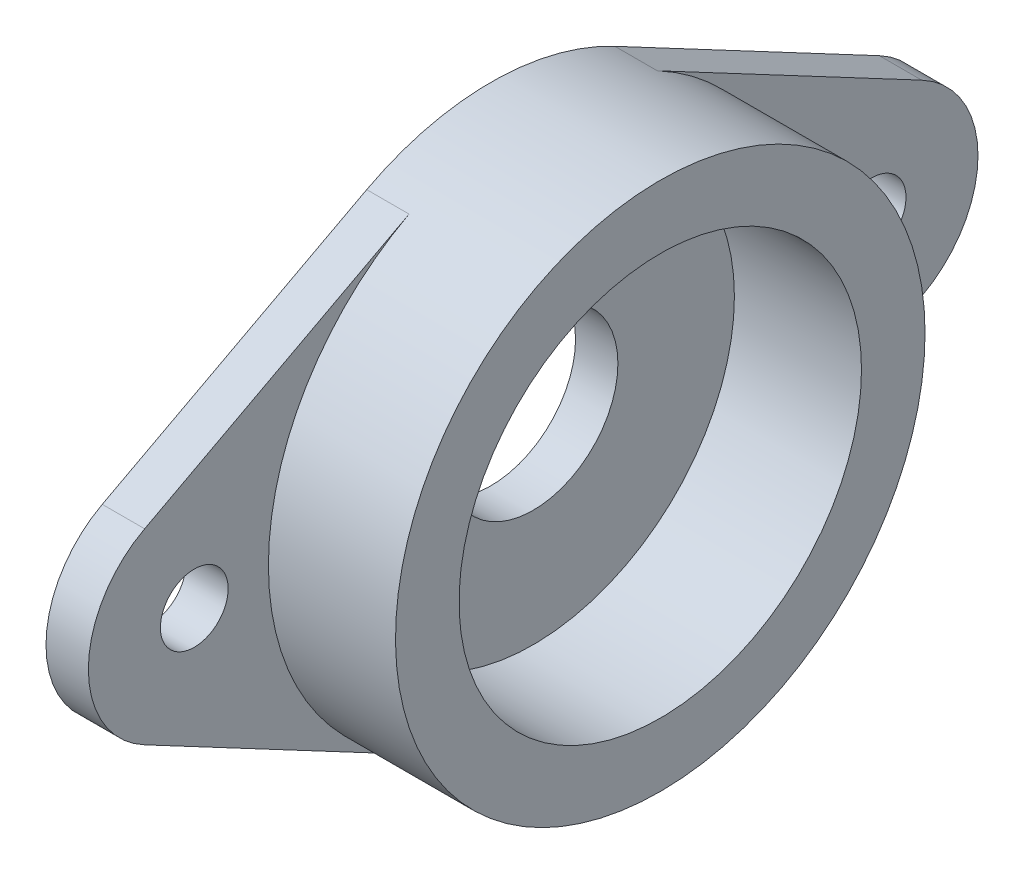
ISO-10303-21;
HEADER;
FILE_DESCRIPTION(('STEP AP214'),'2;1');
FILE_NAME('part.step','',(''),(''),'','','');
FILE_SCHEMA(('AUTOMOTIVE_DESIGN { 1 0 10303 214 1 1 1 1 }'));
ENDSEC;
DATA;
#1=APPLICATION_CONTEXT('core data for automotive mechanical design processes');
#2=APPLICATION_PROTOCOL_DEFINITION('international standard','automotive_design',2000,#1);
#3=PRODUCT_CONTEXT('',#1,'mechanical');
#4=PRODUCT('Part','Part','',(#3));
#5=PRODUCT_RELATED_PRODUCT_CATEGORY('part','',(#4));
#6=PRODUCT_DEFINITION_FORMATION('','',#4);
#7=PRODUCT_DEFINITION_CONTEXT('part definition',#1,'design');
#8=PRODUCT_DEFINITION('design','',#6,#7);
#9=PRODUCT_DEFINITION_SHAPE('','',#8);
#10=(LENGTH_UNIT() NAMED_UNIT(*) SI_UNIT(.MILLI.,.METRE.));
#11=(NAMED_UNIT(*) PLANE_ANGLE_UNIT() SI_UNIT($,.RADIAN.));
#12=(NAMED_UNIT(*) SI_UNIT($,.STERADIAN.) SOLID_ANGLE_UNIT());
#13=UNCERTAINTY_MEASURE_WITH_UNIT(LENGTH_MEASURE(1.E-05),#10,'distance_accuracy_value','');
#14=(GEOMETRIC_REPRESENTATION_CONTEXT(3) GLOBAL_UNCERTAINTY_ASSIGNED_CONTEXT((#13)) GLOBAL_UNIT_ASSIGNED_CONTEXT((#10,
#11,#12)) REPRESENTATION_CONTEXT('',''));
#15=CARTESIAN_POINT('',(0.,0.,0.));
#16=DIRECTION('',(0.,0.,1.));
#17=DIRECTION('',(1.,0.,0.));
#18=AXIS2_PLACEMENT_3D('',#15,#16,#17);
#19=CARTESIAN_POINT('',(49.3553390593274,0.,0.));
#20=DIRECTION('',(-1.,0.,0.));
#21=DIRECTION('',(0.,0.,1.));
#22=AXIS2_PLACEMENT_3D('',#19,#20,#21);
#23=CYLINDRICAL_SURFACE('',#22,12.5);
#24=CARTESIAN_POINT('',(8.,0.,0.));
#25=DIRECTION('',(1.,0.,0.));
#26=DIRECTION('',(0.,0.,-1.));
#27=AXIS2_PLACEMENT_3D('',#24,#25,#26);
#28=CIRCLE('',#27,12.5);
#29=CARTESIAN_POINT('',(8.,0.,-12.5));
#30=VERTEX_POINT('',#29);
#31=EDGE_CURVE('E128',#30,#30,#28,.F.);
#32=ORIENTED_EDGE('',*,*,#31,.T.);
#33=EDGE_LOOP('',(#32));
#34=FACE_BOUND('',#33,.T.);
#35=CARTESIAN_POINT('',(0.,0.,0.));
#36=DIRECTION('',(1.,0.,0.));
#37=DIRECTION('',(0.,0.,-1.));
#38=AXIS2_PLACEMENT_3D('',#35,#36,#37);
#39=CIRCLE('',#38,12.5);
#40=CARTESIAN_POINT('',(0.,-11.0416359571114,-5.859375));
#41=VERTEX_POINT('',#40);
#42=CARTESIAN_POINT('',(0.,-11.0416359571114,5.859375));
#43=VERTEX_POINT('',#42);
#44=EDGE_CURVE('E186',#41,#43,#39,.F.);
#45=ORIENTED_EDGE('',*,*,#44,.F.);
#46=DIRECTION('',(-1.,0.,0.));
#47=VECTOR('',#46,1.);
#48=CARTESIAN_POINT('',(2.,-11.0416359571114,-5.859375));
#49=LINE('',#48,#47);
#50=CARTESIAN_POINT('',(2.,-11.0416359571114,-5.859375));
#51=VERTEX_POINT('',#50);
#52=EDGE_CURVE('E156',#51,#41,#49,.T.);
#53=ORIENTED_EDGE('',*,*,#52,.F.);
#54=CARTESIAN_POINT('',(2.,0.,0.));
#55=DIRECTION('',(1.,0.,0.));
#56=DIRECTION('',(0.,0.,-1.));
#57=AXIS2_PLACEMENT_3D('',#54,#55,#56);
#58=CIRCLE('',#57,12.5);
#59=CARTESIAN_POINT('',(2.,11.0416359571114,-5.859375));
#60=VERTEX_POINT('',#59);
#61=EDGE_CURVE('E142',#60,#51,#58,.F.);
#62=ORIENTED_EDGE('',*,*,#61,.F.);
#63=DIRECTION('',(-1.,0.,0.));
#64=VECTOR('',#63,1.);
#65=CARTESIAN_POINT('',(2.,11.0416359571114,-5.859375));
#66=LINE('',#65,#64);
#67=CARTESIAN_POINT('',(0.,11.0416359571114,-5.859375));
#68=VERTEX_POINT('',#67);
#69=EDGE_CURVE('E171',#60,#68,#66,.T.);
#70=ORIENTED_EDGE('',*,*,#69,.T.);
#71=CARTESIAN_POINT('',(0.,11.0416359571114,5.859375));
#72=VERTEX_POINT('',#71);
#73=EDGE_CURVE('E182',#72,#68,#39,.F.);
#74=ORIENTED_EDGE('',*,*,#73,.F.);
#75=DIRECTION('',(-1.,0.,0.));
#76=VECTOR('',#75,1.);
#77=CARTESIAN_POINT('',(2.,11.0416359571114,5.859375));
#78=LINE('',#77,#76);
#79=CARTESIAN_POINT('',(2.,11.0416359571114,5.859375));
#80=VERTEX_POINT('',#79);
#81=EDGE_CURVE('E221',#80,#72,#78,.T.);
#82=ORIENTED_EDGE('',*,*,#81,.F.);
#83=CARTESIAN_POINT('',(2.,0.,0.));
#84=DIRECTION('',(1.,0.,0.));
#85=DIRECTION('',(0.,0.,-1.));
#86=AXIS2_PLACEMENT_3D('',#83,#84,#85);
#87=CIRCLE('',#86,12.5);
#88=CARTESIAN_POINT('',(2.,-11.0416359571114,5.859375));
#89=VERTEX_POINT('',#88);
#90=EDGE_CURVE('E201',#89,#80,#87,.F.);
#91=ORIENTED_EDGE('',*,*,#90,.F.);
#92=DIRECTION('',(-1.,0.,0.));
#93=VECTOR('',#92,1.);
#94=CARTESIAN_POINT('',(2.,-11.0416359571114,5.859375));
#95=LINE('',#94,#93);
#96=EDGE_CURVE('E58',#89,#43,#95,.T.);
#97=ORIENTED_EDGE('',*,*,#96,.T.);
#98=EDGE_LOOP('',(#45,#53,#62,#70,#74,#82,#91,#97));
#99=FACE_BOUND('',#98,.T.);
#100=ADVANCED_FACE('F49',(#34,#99),#23,.T.);
#101=CARTESIAN_POINT('',(2.,0.,16.));
#102=DIRECTION('',(-1.,0.,0.));
#103=DIRECTION('',(0.,0.,1.));
#104=AXIS2_PLACEMENT_3D('',#101,#102,#103);
#105=CYLINDRICAL_SURFACE('',#104,5.);
#106=CARTESIAN_POINT('',(0.,0.,16.));
#107=DIRECTION('',(1.,0.,0.));
#108=DIRECTION('',(0.,0.,-1.));
#109=AXIS2_PLACEMENT_3D('',#106,#107,#108);
#110=CIRCLE('',#109,5.);
#111=CARTESIAN_POINT('',(0.,-4.41665438284456,18.34375));
#112=VERTEX_POINT('',#111);
#113=CARTESIAN_POINT('',(0.,4.41665438284455,18.34375));
#114=VERTEX_POINT('',#113);
#115=EDGE_CURVE('E210',#112,#114,#110,.F.);
#116=ORIENTED_EDGE('',*,*,#115,.F.);
#117=DIRECTION('',(-1.,0.,0.));
#118=VECTOR('',#117,1.);
#119=CARTESIAN_POINT('',(2.,-4.41665438284456,18.34375));
#120=LINE('',#119,#118);
#121=CARTESIAN_POINT('',(2.,-4.41665438284456,18.34375));
#122=VERTEX_POINT('',#121);
#123=EDGE_CURVE('E12',#122,#112,#120,.T.);
#124=ORIENTED_EDGE('',*,*,#123,.F.);
#125=CARTESIAN_POINT('',(2.,0.,16.));
#126=DIRECTION('',(1.,0.,0.));
#127=DIRECTION('',(0.,0.,-1.));
#128=AXIS2_PLACEMENT_3D('',#125,#126,#127);
#129=CIRCLE('',#128,5.);
#130=CARTESIAN_POINT('',(2.,4.41665438284455,18.34375));
#131=VERTEX_POINT('',#130);
#132=EDGE_CURVE('E194',#122,#131,#129,.F.);
#133=ORIENTED_EDGE('',*,*,#132,.T.);
#134=DIRECTION('',(-1.,0.,0.));
#135=VECTOR('',#134,1.);
#136=CARTESIAN_POINT('',(2.,4.41665438284455,18.34375));
#137=LINE('',#136,#135);
#138=EDGE_CURVE('E74',#131,#114,#137,.T.);
#139=ORIENTED_EDGE('',*,*,#138,.T.);
#140=EDGE_LOOP('',(#116,#124,#133,#139));
#141=FACE_BOUND('',#140,.T.);
#142=ADVANCED_FACE('F237',(#141),#105,.T.);
#143=CARTESIAN_POINT('',(2.,-11.0416359571114,5.859375));
#144=DIRECTION('',(0.,0.883330876568911,-0.46875));
#145=DIRECTION('',(0.,0.46875,0.883330876568911));
#146=AXIS2_PLACEMENT_3D('',#143,#144,#145);
#147=PLANE('',#146);
#148=DIRECTION('',(0.,-0.46875,-0.883330876568911));
#149=VECTOR('',#148,1.);
#150=CARTESIAN_POINT('',(0.,-11.0416359571114,5.859375));
#151=LINE('',#150,#149);
#152=EDGE_CURVE('E213',#112,#43,#151,.T.);
#153=ORIENTED_EDGE('',*,*,#152,.T.);
#154=ORIENTED_EDGE('',*,*,#96,.F.);
#155=DIRECTION('',(0.,-0.46875,-0.883330876568911));
#156=VECTOR('',#155,1.);
#157=CARTESIAN_POINT('',(2.,-11.0416359571114,5.859375));
#158=LINE('',#157,#156);
#159=EDGE_CURVE('E198',#122,#89,#158,.T.);
#160=ORIENTED_EDGE('',*,*,#159,.F.);
#161=ORIENTED_EDGE('',*,*,#123,.T.);
#162=EDGE_LOOP('',(#153,#154,#160,#161));
#163=FACE_BOUND('',#162,.T.);
#164=ADVANCED_FACE('F232',(#163),#147,.F.);
#165=CARTESIAN_POINT('',(2.,0.,16.));
#166=DIRECTION('',(-1.,0.,0.));
#167=DIRECTION('',(0.,0.,1.));
#168=AXIS2_PLACEMENT_3D('',#165,#166,#167);
#169=CYLINDRICAL_SURFACE('',#168,1.6);
#170=CARTESIAN_POINT('',(2.,0.,16.));
#171=DIRECTION('',(1.,0.,0.));
#172=DIRECTION('',(0.,0.,-1.));
#173=AXIS2_PLACEMENT_3D('',#170,#171,#172);
#174=CIRCLE('',#173,1.6);
#175=CARTESIAN_POINT('',(2.,0.,14.4));
#176=VERTEX_POINT('',#175);
#177=EDGE_CURVE('E190',#176,#176,#174,.T.);
#178=ORIENTED_EDGE('',*,*,#177,.T.);
#179=EDGE_LOOP('',(#178));
#180=FACE_BOUND('',#179,.T.);
#181=CARTESIAN_POINT('',(0.,0.,16.));
#182=DIRECTION('',(1.,0.,0.));
#183=DIRECTION('',(0.,0.,-1.));
#184=AXIS2_PLACEMENT_3D('',#181,#182,#183);
#185=CIRCLE('',#184,1.6);
#186=CARTESIAN_POINT('',(0.,0.,14.4));
#187=VERTEX_POINT('',#186);
#188=EDGE_CURVE('E181',#187,#187,#185,.T.);
#189=ORIENTED_EDGE('',*,*,#188,.F.);
#190=EDGE_LOOP('',(#189));
#191=FACE_BOUND('',#190,.T.);
#192=ADVANCED_FACE('F51',(#180,#191),#169,.F.);
#193=CARTESIAN_POINT('',(2.,11.0416359571114,5.859375));
#194=DIRECTION('',(0.,0.883330876568911,0.46875));
#195=DIRECTION('',(0.,-0.46875,0.883330876568911));
#196=AXIS2_PLACEMENT_3D('',#193,#194,#195);
#197=PLANE('',#196);
#198=DIRECTION('',(0.,0.46875,-0.883330876568911));
#199=VECTOR('',#198,1.);
#200=CARTESIAN_POINT('',(0.,11.0416359571114,5.859375));
#201=LINE('',#200,#199);
#202=EDGE_CURVE('E195',#114,#72,#201,.T.);
#203=ORIENTED_EDGE('',*,*,#202,.F.);
#204=ORIENTED_EDGE('',*,*,#138,.F.);
#205=DIRECTION('',(0.,0.46875,-0.883330876568911));
#206=VECTOR('',#205,1.);
#207=CARTESIAN_POINT('',(2.,11.0416359571114,5.859375));
#208=LINE('',#207,#206);
#209=EDGE_CURVE('E204',#131,#80,#208,.T.);
#210=ORIENTED_EDGE('',*,*,#209,.T.);
#211=ORIENTED_EDGE('',*,*,#81,.T.);
#212=EDGE_LOOP('',(#203,#204,#210,#211));
#213=FACE_BOUND('',#212,.T.);
#214=ADVANCED_FACE('F248',(#213),#197,.T.);
#215=CARTESIAN_POINT('',(2.,0.,0.));
#216=DIRECTION('',(1.,0.,0.));
#217=DIRECTION('',(0.,0.,-1.));
#218=AXIS2_PLACEMENT_3D('',#215,#216,#217);
#219=PLANE('',#218);
#220=ORIENTED_EDGE('',*,*,#177,.F.);
#221=EDGE_LOOP('',(#220));
#222=FACE_BOUND('',#221,.T.);
#223=ORIENTED_EDGE('',*,*,#132,.F.);
#224=ORIENTED_EDGE('',*,*,#159,.T.);
#225=ORIENTED_EDGE('',*,*,#90,.T.);
#226=ORIENTED_EDGE('',*,*,#209,.F.);
#227=EDGE_LOOP('',(#223,#224,#225,#226));
#228=FACE_BOUND('',#227,.T.);
#229=ADVANCED_FACE('F251',(#222,#228),#219,.T.);
#230=CARTESIAN_POINT('',(0.,0.,0.));
#231=DIRECTION('',(1.,0.,0.));
#232=DIRECTION('',(0.,0.,-1.));
#233=AXIS2_PLACEMENT_3D('',#230,#231,#232);
#234=PLANE('',#233);
#235=ORIENTED_EDGE('',*,*,#188,.T.);
#236=EDGE_LOOP('',(#235));
#237=FACE_BOUND('',#236,.T.);
#238=ORIENTED_EDGE('',*,*,#115,.T.);
#239=ORIENTED_EDGE('',*,*,#202,.T.);
#240=ORIENTED_EDGE('',*,*,#73,.T.);
#241=DIRECTION('',(0.,0.46875,0.883330876568911));
#242=VECTOR('',#241,1.);
#243=CARTESIAN_POINT('',(0.,11.0416359571114,-5.859375));
#244=LINE('',#243,#242);
#245=CARTESIAN_POINT('',(0.,4.41665438284455,-18.34375));
#246=VERTEX_POINT('',#245);
#247=EDGE_CURVE('E148',#246,#68,#244,.T.);
#248=ORIENTED_EDGE('',*,*,#247,.F.);
#249=CARTESIAN_POINT('',(0.,0.,-16.));
#250=DIRECTION('',(1.,0.,0.));
#251=DIRECTION('',(0.,0.,-1.));
#252=AXIS2_PLACEMENT_3D('',#249,#250,#251);
#253=CIRCLE('',#252,5.);
#254=CARTESIAN_POINT('',(0.,-4.41665438284456,-18.34375));
#255=VERTEX_POINT('',#254);
#256=EDGE_CURVE('E164',#255,#246,#253,.T.);
#257=ORIENTED_EDGE('',*,*,#256,.F.);
#258=DIRECTION('',(0.,-0.46875,0.883330876568911));
#259=VECTOR('',#258,1.);
#260=CARTESIAN_POINT('',(0.,-11.0416359571114,-5.859375));
#261=LINE('',#260,#259);
#262=EDGE_CURVE('E65',#255,#41,#261,.T.);
#263=ORIENTED_EDGE('',*,*,#262,.T.);
#264=ORIENTED_EDGE('',*,*,#44,.T.);
#265=ORIENTED_EDGE('',*,*,#152,.F.);
#266=EDGE_LOOP('',(#238,#239,#240,#248,#257,#263,#264,#265));
#267=FACE_BOUND('',#266,.T.);
#268=CARTESIAN_POINT('',(0.,0.,-16.));
#269=DIRECTION('',(1.,0.,0.));
#270=DIRECTION('',(0.,0.,-1.));
#271=AXIS2_PLACEMENT_3D('',#268,#269,#270);
#272=CIRCLE('',#271,1.60000000000001);
#273=CARTESIAN_POINT('',(0.,0.,-17.6));
#274=VERTEX_POINT('',#273);
#275=EDGE_CURVE('E157',#274,#274,#272,.F.);
#276=ORIENTED_EDGE('',*,*,#275,.F.);
#277=EDGE_LOOP('',(#276));
#278=FACE_BOUND('',#277,.T.);
#279=CARTESIAN_POINT('',(0.,0.,0.));
#280=DIRECTION('',(1.,0.,0.));
#281=DIRECTION('',(0.,0.,-1.));
#282=AXIS2_PLACEMENT_3D('',#279,#280,#281);
#283=CIRCLE('',#282,4.);
#284=CARTESIAN_POINT('',(0.,0.,-4.));
#285=VERTEX_POINT('',#284);
#286=EDGE_CURVE('E299',#285,#285,#283,.T.);
#287=ORIENTED_EDGE('',*,*,#286,.T.);
#288=EDGE_LOOP('',(#287));
#289=FACE_BOUND('',#288,.T.);
#290=ADVANCED_FACE('F235',(#237,#267,#278,#289),#234,.F.);
#291=CARTESIAN_POINT('',(49.3553390593274,0.,0.));
#292=DIRECTION('',(-1.,0.,0.));
#293=DIRECTION('',(0.,0.,1.));
#294=AXIS2_PLACEMENT_3D('',#291,#292,#293);
#295=CYLINDRICAL_SURFACE('',#294,9.5);
#296=CARTESIAN_POINT('',(2.,0.,0.));
#297=DIRECTION('',(1.,0.,0.));
#298=DIRECTION('',(0.,0.,-1.));
#299=AXIS2_PLACEMENT_3D('',#296,#297,#298);
#300=CIRCLE('',#299,9.5);
#301=CARTESIAN_POINT('',(2.,0.,-9.5));
#302=VERTEX_POINT('',#301);
#303=EDGE_CURVE('E161',#302,#302,#300,.F.);
#304=ORIENTED_EDGE('',*,*,#303,.T.);
#305=EDGE_LOOP('',(#304));
#306=FACE_BOUND('',#305,.T.);
#307=CARTESIAN_POINT('',(8.,0.,0.));
#308=DIRECTION('',(1.,0.,0.));
#309=DIRECTION('',(0.,0.,-1.));
#310=AXIS2_PLACEMENT_3D('',#307,#308,#309);
#311=CIRCLE('',#310,9.5);
#312=CARTESIAN_POINT('',(8.,0.,-9.5));
#313=VERTEX_POINT('',#312);
#314=EDGE_CURVE('E177',#313,#313,#311,.F.);
#315=ORIENTED_EDGE('',*,*,#314,.F.);
#316=EDGE_LOOP('',(#315));
#317=FACE_BOUND('',#316,.T.);
#318=ADVANCED_FACE('F254',(#306,#317),#295,.F.);
#319=CARTESIAN_POINT('',(8.,0.,0.));
#320=DIRECTION('',(1.,0.,0.));
#321=DIRECTION('',(0.,0.,-1.));
#322=AXIS2_PLACEMENT_3D('',#319,#320,#321);
#323=PLANE('',#322);
#324=ORIENTED_EDGE('',*,*,#31,.F.);
#325=EDGE_LOOP('',(#324));
#326=FACE_BOUND('',#325,.T.);
#327=ORIENTED_EDGE('',*,*,#314,.T.);
#328=EDGE_LOOP('',(#327));
#329=FACE_BOUND('',#328,.T.);
#330=ADVANCED_FACE('F260',(#326,#329),#323,.T.);
#331=CARTESIAN_POINT('',(2.,-11.0416359571114,-5.859375));
#332=DIRECTION('',(0.,-0.883330876568911,-0.46875));
#333=DIRECTION('',(0.,0.46875,-0.883330876568911));
#334=AXIS2_PLACEMENT_3D('',#331,#332,#333);
#335=PLANE('',#334);
#336=ORIENTED_EDGE('',*,*,#262,.F.);
#337=DIRECTION('',(-1.,0.,0.));
#338=VECTOR('',#337,1.);
#339=CARTESIAN_POINT('',(2.,-4.41665438284456,-18.34375));
#340=LINE('',#339,#338);
#341=CARTESIAN_POINT('',(2.,-4.41665438284456,-18.34375));
#342=VERTEX_POINT('',#341);
#343=EDGE_CURVE('E119',#342,#255,#340,.T.);
#344=ORIENTED_EDGE('',*,*,#343,.F.);
#345=DIRECTION('',(0.,-0.46875,0.883330876568911));
#346=VECTOR('',#345,1.);
#347=CARTESIAN_POINT('',(2.,-11.0416359571114,-5.859375));
#348=LINE('',#347,#346);
#349=EDGE_CURVE('E123',#342,#51,#348,.T.);
#350=ORIENTED_EDGE('',*,*,#349,.T.);
#351=ORIENTED_EDGE('',*,*,#52,.T.);
#352=EDGE_LOOP('',(#336,#344,#350,#351));
#353=FACE_BOUND('',#352,.T.);
#354=ADVANCED_FACE('F121',(#353),#335,.T.);
#355=CARTESIAN_POINT('',(2.,0.,-16.));
#356=DIRECTION('',(-1.,0.,0.));
#357=DIRECTION('',(0.,0.,1.));
#358=AXIS2_PLACEMENT_3D('',#355,#356,#357);
#359=CYLINDRICAL_SURFACE('',#358,5.);
#360=ORIENTED_EDGE('',*,*,#256,.T.);
#361=DIRECTION('',(-1.,0.,0.));
#362=VECTOR('',#361,1.);
#363=CARTESIAN_POINT('',(2.,4.41665438284455,-18.34375));
#364=LINE('',#363,#362);
#365=CARTESIAN_POINT('',(2.,4.41665438284455,-18.34375));
#366=VERTEX_POINT('',#365);
#367=EDGE_CURVE('E129',#366,#246,#364,.T.);
#368=ORIENTED_EDGE('',*,*,#367,.F.);
#369=CARTESIAN_POINT('',(2.,0.,-16.));
#370=DIRECTION('',(1.,0.,0.));
#371=DIRECTION('',(0.,0.,-1.));
#372=AXIS2_PLACEMENT_3D('',#369,#370,#371);
#373=CIRCLE('',#372,5.);
#374=EDGE_CURVE('E133',#342,#366,#373,.T.);
#375=ORIENTED_EDGE('',*,*,#374,.F.);
#376=ORIENTED_EDGE('',*,*,#343,.T.);
#377=EDGE_LOOP('',(#360,#368,#375,#376));
#378=FACE_BOUND('',#377,.T.);
#379=ADVANCED_FACE('F134',(#378),#359,.T.);
#380=CARTESIAN_POINT('',(2.,11.0416359571114,-5.859375));
#381=DIRECTION('',(0.,-0.883330876568911,0.46875));
#382=DIRECTION('',(0.,-0.46875,-0.883330876568911));
#383=AXIS2_PLACEMENT_3D('',#380,#381,#382);
#384=PLANE('',#383);
#385=ORIENTED_EDGE('',*,*,#247,.T.);
#386=ORIENTED_EDGE('',*,*,#69,.F.);
#387=DIRECTION('',(0.,0.46875,0.883330876568911));
#388=VECTOR('',#387,1.);
#389=CARTESIAN_POINT('',(2.,11.0416359571114,-5.859375));
#390=LINE('',#389,#388);
#391=EDGE_CURVE('E138',#366,#60,#390,.T.);
#392=ORIENTED_EDGE('',*,*,#391,.F.);
#393=ORIENTED_EDGE('',*,*,#367,.T.);
#394=EDGE_LOOP('',(#385,#386,#392,#393));
#395=FACE_BOUND('',#394,.T.);
#396=ADVANCED_FACE('F269',(#395),#384,.F.);
#397=CARTESIAN_POINT('',(2.,0.,-16.));
#398=DIRECTION('',(-1.,0.,0.));
#399=DIRECTION('',(0.,0.,1.));
#400=AXIS2_PLACEMENT_3D('',#397,#398,#399);
#401=CYLINDRICAL_SURFACE('',#400,1.60000000000001);
#402=CARTESIAN_POINT('',(2.,0.,-16.));
#403=DIRECTION('',(1.,0.,0.));
#404=DIRECTION('',(0.,0.,-1.));
#405=AXIS2_PLACEMENT_3D('',#402,#403,#404);
#406=CIRCLE('',#405,1.60000000000001);
#407=CARTESIAN_POINT('',(2.,0.,-17.6));
#408=VERTEX_POINT('',#407);
#409=EDGE_CURVE('E144',#408,#408,#406,.F.);
#410=ORIENTED_EDGE('',*,*,#409,.F.);
#411=EDGE_LOOP('',(#410));
#412=FACE_BOUND('',#411,.T.);
#413=ORIENTED_EDGE('',*,*,#275,.T.);
#414=EDGE_LOOP('',(#413));
#415=FACE_BOUND('',#414,.T.);
#416=ADVANCED_FACE('F266',(#412,#415),#401,.F.);
#417=CARTESIAN_POINT('',(2.,0.,0.));
#418=DIRECTION('',(1.,0.,0.));
#419=DIRECTION('',(0.,0.,-1.));
#420=AXIS2_PLACEMENT_3D('',#417,#418,#419);
#421=PLANE('',#420);
#422=ORIENTED_EDGE('',*,*,#409,.T.);
#423=EDGE_LOOP('',(#422));
#424=FACE_BOUND('',#423,.T.);
#425=ORIENTED_EDGE('',*,*,#349,.F.);
#426=ORIENTED_EDGE('',*,*,#374,.T.);
#427=ORIENTED_EDGE('',*,*,#391,.T.);
#428=ORIENTED_EDGE('',*,*,#61,.T.);
#429=EDGE_LOOP('',(#425,#426,#427,#428));
#430=FACE_BOUND('',#429,.T.);
#431=ADVANCED_FACE('F140',(#424,#430),#421,.T.);
#432=CARTESIAN_POINT('',(2.,0.,0.));
#433=DIRECTION('',(-1.,0.,0.));
#434=DIRECTION('',(0.,0.,1.));
#435=AXIS2_PLACEMENT_3D('',#432,#433,#434);
#436=CYLINDRICAL_SURFACE('',#435,4.);
#437=CARTESIAN_POINT('',(2.,0.,0.));
#438=DIRECTION('',(1.,0.,0.));
#439=DIRECTION('',(0.,0.,-1.));
#440=AXIS2_PLACEMENT_3D('',#437,#438,#439);
#441=CIRCLE('',#440,4.);
#442=CARTESIAN_POINT('',(2.,0.,-4.));
#443=VERTEX_POINT('',#442);
#444=EDGE_CURVE('E293',#443,#443,#441,.T.);
#445=ORIENTED_EDGE('',*,*,#444,.T.);
#446=EDGE_LOOP('',(#445));
#447=FACE_BOUND('',#446,.T.);
#448=ORIENTED_EDGE('',*,*,#286,.F.);
#449=EDGE_LOOP('',(#448));
#450=FACE_BOUND('',#449,.T.);
#451=ADVANCED_FACE('F280',(#447,#450),#436,.F.);
#452=CARTESIAN_POINT('',(2.,0.,0.));
#453=DIRECTION('',(1.,0.,0.));
#454=DIRECTION('',(0.,0.,-1.));
#455=AXIS2_PLACEMENT_3D('',#452,#453,#454);
#456=PLANE('',#455);
#457=ORIENTED_EDGE('',*,*,#444,.F.);
#458=EDGE_LOOP('',(#457));
#459=FACE_BOUND('',#458,.T.);
#460=ORIENTED_EDGE('',*,*,#303,.F.);
#461=EDGE_LOOP('',(#460));
#462=FACE_BOUND('',#461,.T.);
#463=ADVANCED_FACE('F284',(#459,#462),#456,.T.);
#464=CLOSED_SHELL('',(#100,#142,#164,#192,#214,#229,#290,#318,#330,#354,#379,#396,#416,#431,
#451,#463));
#465=MANIFOLD_SOLID_BREP('B2',#464);
#466=ADVANCED_BREP_SHAPE_REPRESENTATION('',(#18,#465),#14);
#467=SHAPE_DEFINITION_REPRESENTATION(#9,#466);
ENDSEC;
END-ISO-10303-21;
